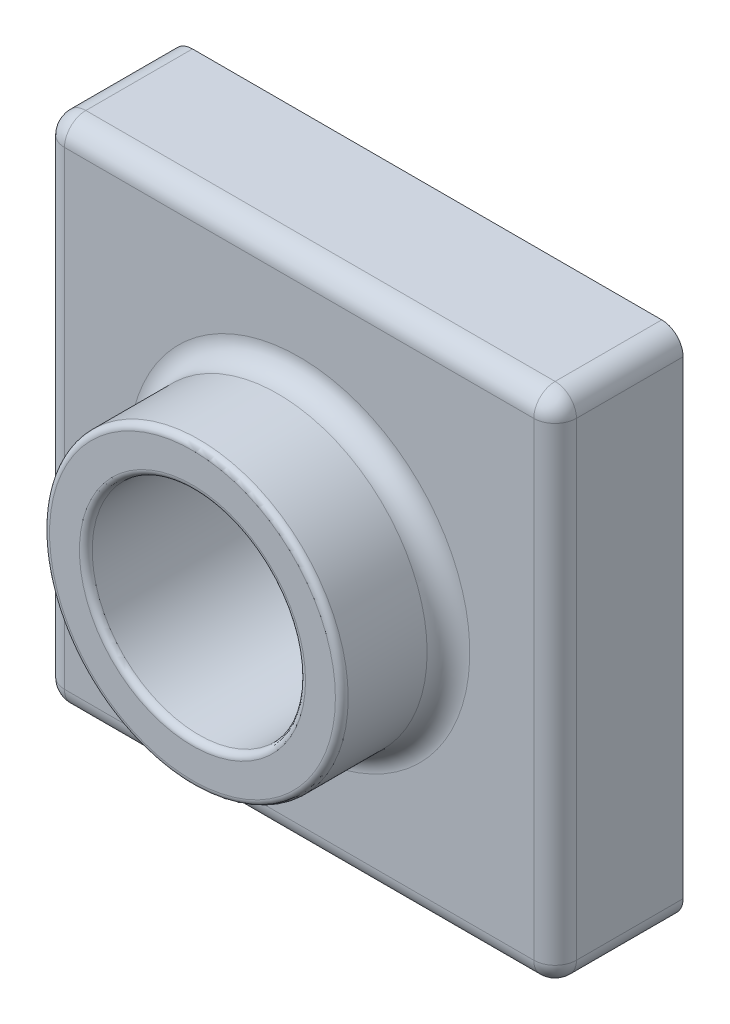
ISO-10303-21;
HEADER;
FILE_DESCRIPTION(('STEP AP214'),'2;1');
FILE_NAME('part.step','',(''),(''),'','','');
FILE_SCHEMA(('AUTOMOTIVE_DESIGN { 1 0 10303 214 1 1 1 1 }'));
ENDSEC;
DATA;
#1=APPLICATION_CONTEXT('core data for automotive mechanical design processes');
#2=APPLICATION_PROTOCOL_DEFINITION('international standard','automotive_design',2000,#1);
#3=PRODUCT_CONTEXT('',#1,'mechanical');
#4=PRODUCT('Part','Part','',(#3));
#5=PRODUCT_RELATED_PRODUCT_CATEGORY('part','',(#4));
#6=PRODUCT_DEFINITION_FORMATION('','',#4);
#7=PRODUCT_DEFINITION_CONTEXT('part definition',#1,'design');
#8=PRODUCT_DEFINITION('design','',#6,#7);
#9=PRODUCT_DEFINITION_SHAPE('','',#8);
#10=(LENGTH_UNIT() NAMED_UNIT(*) SI_UNIT(.MILLI.,.METRE.));
#11=(NAMED_UNIT(*) PLANE_ANGLE_UNIT() SI_UNIT($,.RADIAN.));
#12=(NAMED_UNIT(*) SI_UNIT($,.STERADIAN.) SOLID_ANGLE_UNIT());
#13=UNCERTAINTY_MEASURE_WITH_UNIT(LENGTH_MEASURE(1.E-05),#10,'distance_accuracy_value','');
#14=(GEOMETRIC_REPRESENTATION_CONTEXT(3) GLOBAL_UNCERTAINTY_ASSIGNED_CONTEXT((#13)) GLOBAL_UNIT_ASSIGNED_CONTEXT((#10,
#11,#12)) REPRESENTATION_CONTEXT('',''));
#15=CARTESIAN_POINT('',(0.,0.,0.));
#16=DIRECTION('',(0.,0.,1.));
#17=DIRECTION('',(1.,0.,0.));
#18=AXIS2_PLACEMENT_3D('',#15,#16,#17);
#19=CARTESIAN_POINT('',(0.,0.,0.));
#20=DIRECTION('',(0.,0.,-1.));
#21=DIRECTION('',(-1.,0.,0.));
#22=AXIS2_PLACEMENT_3D('',#19,#20,#21);
#23=PLANE('',#22);
#24=DIRECTION('',(1.,0.,0.));
#25=VECTOR('',#24,1.);
#26=CARTESIAN_POINT('',(0.,0.,0.));
#27=LINE('',#26,#25);
#28=CARTESIAN_POINT('',(5.,0.,0.));
#29=VERTEX_POINT('',#28);
#30=CARTESIAN_POINT('',(115.,0.,0.));
#31=VERTEX_POINT('',#30);
#32=EDGE_CURVE('E281',#29,#31,#27,.T.);
#33=ORIENTED_EDGE('',*,*,#32,.F.);
#34=CARTESIAN_POINT('',(5.,5.,0.));
#35=DIRECTION('',(0.,0.,-1.));
#36=DIRECTION('',(-1.,0.,0.));
#37=AXIS2_PLACEMENT_3D('',#34,#35,#36);
#38=CIRCLE('',#37,5.);
#39=CARTESIAN_POINT('',(0.,5.,0.));
#40=VERTEX_POINT('',#39);
#41=EDGE_CURVE('E325',#29,#40,#38,.T.);
#42=ORIENTED_EDGE('',*,*,#41,.T.);
#43=DIRECTION('',(0.,-1.,0.));
#44=VECTOR('',#43,1.);
#45=CARTESIAN_POINT('',(0.,0.,0.));
#46=LINE('',#45,#44);
#47=CARTESIAN_POINT('',(0.,115.,0.));
#48=VERTEX_POINT('',#47);
#49=EDGE_CURVE('E277',#48,#40,#46,.T.);
#50=ORIENTED_EDGE('',*,*,#49,.F.);
#51=CARTESIAN_POINT('',(5.,115.,0.));
#52=DIRECTION('',(0.,0.,-1.));
#53=DIRECTION('',(-1.,0.,0.));
#54=AXIS2_PLACEMENT_3D('',#51,#52,#53);
#55=CIRCLE('',#54,5.);
#56=CARTESIAN_POINT('',(5.,120.,0.));
#57=VERTEX_POINT('',#56);
#58=EDGE_CURVE('E319',#48,#57,#55,.T.);
#59=ORIENTED_EDGE('',*,*,#58,.T.);
#60=DIRECTION('',(-1.,0.,0.));
#61=VECTOR('',#60,1.);
#62=CARTESIAN_POINT('',(0.,120.,0.));
#63=LINE('',#62,#61);
#64=CARTESIAN_POINT('',(115.,120.,0.));
#65=VERTEX_POINT('',#64);
#66=EDGE_CURVE('E289',#65,#57,#63,.T.);
#67=ORIENTED_EDGE('',*,*,#66,.F.);
#68=CARTESIAN_POINT('',(115.,115.,0.));
#69=DIRECTION('',(0.,0.,-1.));
#70=DIRECTION('',(-1.,0.,0.));
#71=AXIS2_PLACEMENT_3D('',#68,#69,#70);
#72=CIRCLE('',#71,5.);
#73=CARTESIAN_POINT('',(120.,115.,0.));
#74=VERTEX_POINT('',#73);
#75=EDGE_CURVE('E316',#65,#74,#72,.T.);
#76=ORIENTED_EDGE('',*,*,#75,.T.);
#77=DIRECTION('',(0.,1.,0.));
#78=VECTOR('',#77,1.);
#79=CARTESIAN_POINT('',(120.,0.,0.));
#80=LINE('',#79,#78);
#81=CARTESIAN_POINT('',(120.,5.,0.));
#82=VERTEX_POINT('',#81);
#83=EDGE_CURVE('E285',#82,#74,#80,.T.);
#84=ORIENTED_EDGE('',*,*,#83,.F.);
#85=CARTESIAN_POINT('',(115.,5.,0.));
#86=DIRECTION('',(0.,0.,-1.));
#87=DIRECTION('',(-1.,0.,0.));
#88=AXIS2_PLACEMENT_3D('',#85,#86,#87);
#89=CIRCLE('',#88,5.);
#90=EDGE_CURVE('E322',#82,#31,#89,.T.);
#91=ORIENTED_EDGE('',*,*,#90,.T.);
#92=EDGE_LOOP('',(#33,#42,#50,#59,#67,#76,#84,#91));
#93=FACE_BOUND('',#92,.T.);
#94=CARTESIAN_POINT('',(5.,5.,0.));
#95=DIRECTION('',(0.,0.,-1.));
#96=DIRECTION('',(-1.,0.,0.));
#97=AXIS2_PLACEMENT_3D('',#94,#95,#96);
#98=CIRCLE('',#97,3.);
#99=CARTESIAN_POINT('',(5.,2.,0.));
#100=VERTEX_POINT('',#99);
#101=CARTESIAN_POINT('',(2.,5.,0.));
#102=VERTEX_POINT('',#101);
#103=EDGE_CURVE('E209',#100,#102,#98,.T.);
#104=ORIENTED_EDGE('',*,*,#103,.F.);
#105=DIRECTION('',(1.,0.,0.));
#106=VECTOR('',#105,1.);
#107=CARTESIAN_POINT('',(0.,2.,0.));
#108=LINE('',#107,#106);
#109=CARTESIAN_POINT('',(115.,2.,0.));
#110=VERTEX_POINT('',#109);
#111=EDGE_CURVE('E247',#100,#110,#108,.T.);
#112=ORIENTED_EDGE('',*,*,#111,.T.);
#113=CARTESIAN_POINT('',(115.,5.,0.));
#114=DIRECTION('',(0.,0.,-1.));
#115=DIRECTION('',(-1.,0.,0.));
#116=AXIS2_PLACEMENT_3D('',#113,#114,#115);
#117=CIRCLE('',#116,3.);
#118=CARTESIAN_POINT('',(118.,5.,0.));
#119=VERTEX_POINT('',#118);
#120=EDGE_CURVE('E252',#119,#110,#117,.T.);
#121=ORIENTED_EDGE('',*,*,#120,.F.);
#122=DIRECTION('',(0.,1.,0.));
#123=VECTOR('',#122,1.);
#124=CARTESIAN_POINT('',(118.,0.,0.));
#125=LINE('',#124,#123);
#126=CARTESIAN_POINT('',(118.,115.,0.));
#127=VERTEX_POINT('',#126);
#128=EDGE_CURVE('E59',#119,#127,#125,.T.);
#129=ORIENTED_EDGE('',*,*,#128,.T.);
#130=CARTESIAN_POINT('',(115.,115.,0.));
#131=DIRECTION('',(0.,0.,-1.));
#132=DIRECTION('',(-1.,0.,0.));
#133=AXIS2_PLACEMENT_3D('',#130,#131,#132);
#134=CIRCLE('',#133,3.);
#135=CARTESIAN_POINT('',(115.,118.,0.));
#136=VERTEX_POINT('',#135);
#137=EDGE_CURVE('E253',#136,#127,#134,.T.);
#138=ORIENTED_EDGE('',*,*,#137,.F.);
#139=DIRECTION('',(-1.,0.,0.));
#140=VECTOR('',#139,1.);
#141=CARTESIAN_POINT('',(0.,118.,0.));
#142=LINE('',#141,#140);
#143=CARTESIAN_POINT('',(5.,118.,0.));
#144=VERTEX_POINT('',#143);
#145=EDGE_CURVE('E240',#136,#144,#142,.T.);
#146=ORIENTED_EDGE('',*,*,#145,.T.);
#147=CARTESIAN_POINT('',(5.,115.,0.));
#148=DIRECTION('',(0.,0.,-1.));
#149=DIRECTION('',(-1.,0.,0.));
#150=AXIS2_PLACEMENT_3D('',#147,#148,#149);
#151=CIRCLE('',#150,3.);
#152=CARTESIAN_POINT('',(2.,115.,0.));
#153=VERTEX_POINT('',#152);
#154=EDGE_CURVE('E249',#153,#144,#151,.T.);
#155=ORIENTED_EDGE('',*,*,#154,.F.);
#156=DIRECTION('',(0.,-1.,0.));
#157=VECTOR('',#156,1.);
#158=CARTESIAN_POINT('',(2.,0.,0.));
#159=LINE('',#158,#157);
#160=EDGE_CURVE('E204',#153,#102,#159,.T.);
#161=ORIENTED_EDGE('',*,*,#160,.T.);
#162=EDGE_LOOP('',(#104,#112,#121,#129,#138,#146,#155,#161));
#163=FACE_BOUND('',#162,.T.);
#164=ADVANCED_FACE('F41',(#93,#163),#23,.T.);
#165=CARTESIAN_POINT('',(0.,0.,30.));
#166=DIRECTION('',(1.,0.,0.));
#167=DIRECTION('',(0.,0.,-1.));
#168=AXIS2_PLACEMENT_3D('',#165,#166,#167);
#169=PLANE('',#168);
#170=DIRECTION('',(0.,0.,-1.));
#171=VECTOR('',#170,1.);
#172=CARTESIAN_POINT('',(0.,5.,30.));
#173=LINE('',#172,#171);
#174=CARTESIAN_POINT('',(0.,5.,25.));
#175=VERTEX_POINT('',#174);
#176=EDGE_CURVE('E331',#40,#175,#173,.F.);
#177=ORIENTED_EDGE('',*,*,#176,.T.);
#178=DIRECTION('',(0.,-1.,0.));
#179=VECTOR('',#178,1.);
#180=CARTESIAN_POINT('',(0.,0.,25.));
#181=LINE('',#180,#179);
#182=CARTESIAN_POINT('',(0.,115.,25.));
#183=VERTEX_POINT('',#182);
#184=EDGE_CURVE('E51',#175,#183,#181,.F.);
#185=ORIENTED_EDGE('',*,*,#184,.T.);
#186=DIRECTION('',(0.,0.,-1.));
#187=VECTOR('',#186,1.);
#188=CARTESIAN_POINT('',(0.,115.,30.));
#189=LINE('',#188,#187);
#190=EDGE_CURVE('E328',#183,#48,#189,.T.);
#191=ORIENTED_EDGE('',*,*,#190,.T.);
#192=ORIENTED_EDGE('',*,*,#49,.T.);
#193=EDGE_LOOP('',(#177,#185,#191,#192));
#194=FACE_BOUND('',#193,.T.);
#195=ADVANCED_FACE('F471',(#194),#169,.F.);
#196=CARTESIAN_POINT('',(0.,0.,30.));
#197=DIRECTION('',(0.,1.,0.));
#198=DIRECTION('',(0.,0.,1.));
#199=AXIS2_PLACEMENT_3D('',#196,#197,#198);
#200=PLANE('',#199);
#201=DIRECTION('',(0.,0.,-1.));
#202=VECTOR('',#201,1.);
#203=CARTESIAN_POINT('',(115.,0.,30.));
#204=LINE('',#203,#202);
#205=CARTESIAN_POINT('',(115.,0.,25.));
#206=VERTEX_POINT('',#205);
#207=EDGE_CURVE('E309',#31,#206,#204,.F.);
#208=ORIENTED_EDGE('',*,*,#207,.T.);
#209=DIRECTION('',(1.,0.,0.));
#210=VECTOR('',#209,1.);
#211=CARTESIAN_POINT('',(0.,0.,25.));
#212=LINE('',#211,#210);
#213=CARTESIAN_POINT('',(5.,0.,25.));
#214=VERTEX_POINT('',#213);
#215=EDGE_CURVE('E381',#206,#214,#212,.F.);
#216=ORIENTED_EDGE('',*,*,#215,.T.);
#217=DIRECTION('',(0.,0.,-1.));
#218=VECTOR('',#217,1.);
#219=CARTESIAN_POINT('',(5.,0.,30.));
#220=LINE('',#219,#218);
#221=EDGE_CURVE('E313',#214,#29,#220,.T.);
#222=ORIENTED_EDGE('',*,*,#221,.T.);
#223=ORIENTED_EDGE('',*,*,#32,.T.);
#224=EDGE_LOOP('',(#208,#216,#222,#223));
#225=FACE_BOUND('',#224,.T.);
#226=ADVANCED_FACE('F432',(#225),#200,.F.);
#227=CARTESIAN_POINT('',(120.,0.,30.));
#228=DIRECTION('',(-1.,0.,0.));
#229=DIRECTION('',(0.,0.,1.));
#230=AXIS2_PLACEMENT_3D('',#227,#228,#229);
#231=PLANE('',#230);
#232=DIRECTION('',(0.,0.,-1.));
#233=VECTOR('',#232,1.);
#234=CARTESIAN_POINT('',(120.,115.,30.));
#235=LINE('',#234,#233);
#236=CARTESIAN_POINT('',(120.,115.,25.));
#237=VERTEX_POINT('',#236);
#238=EDGE_CURVE('E334',#74,#237,#235,.F.);
#239=ORIENTED_EDGE('',*,*,#238,.T.);
#240=DIRECTION('',(0.,1.,0.));
#241=VECTOR('',#240,1.);
#242=CARTESIAN_POINT('',(120.,0.,25.));
#243=LINE('',#242,#241);
#244=CARTESIAN_POINT('',(120.,5.,25.));
#245=VERTEX_POINT('',#244);
#246=EDGE_CURVE('E375',#237,#245,#243,.F.);
#247=ORIENTED_EDGE('',*,*,#246,.T.);
#248=DIRECTION('',(0.,0.,-1.));
#249=VECTOR('',#248,1.);
#250=CARTESIAN_POINT('',(120.,5.,30.));
#251=LINE('',#250,#249);
#252=EDGE_CURVE('E338',#245,#82,#251,.T.);
#253=ORIENTED_EDGE('',*,*,#252,.T.);
#254=ORIENTED_EDGE('',*,*,#83,.T.);
#255=EDGE_LOOP('',(#239,#247,#253,#254));
#256=FACE_BOUND('',#255,.T.);
#257=ADVANCED_FACE('F443',(#256),#231,.F.);
#258=CARTESIAN_POINT('',(0.,120.,30.));
#259=DIRECTION('',(0.,-1.,0.));
#260=DIRECTION('',(0.,0.,-1.));
#261=AXIS2_PLACEMENT_3D('',#258,#259,#260);
#262=PLANE('',#261);
#263=DIRECTION('',(0.,0.,-1.));
#264=VECTOR('',#263,1.);
#265=CARTESIAN_POINT('',(5.,120.,30.));
#266=LINE('',#265,#264);
#267=CARTESIAN_POINT('',(5.,120.,25.));
#268=VERTEX_POINT('',#267);
#269=EDGE_CURVE('E344',#57,#268,#266,.F.);
#270=ORIENTED_EDGE('',*,*,#269,.T.);
#271=DIRECTION('',(-1.,0.,0.));
#272=VECTOR('',#271,1.);
#273=CARTESIAN_POINT('',(0.,120.,25.));
#274=LINE('',#273,#272);
#275=CARTESIAN_POINT('',(115.,120.,25.));
#276=VERTEX_POINT('',#275);
#277=EDGE_CURVE('E369',#268,#276,#274,.F.);
#278=ORIENTED_EDGE('',*,*,#277,.T.);
#279=DIRECTION('',(0.,0.,-1.));
#280=VECTOR('',#279,1.);
#281=CARTESIAN_POINT('',(115.,120.,30.));
#282=LINE('',#281,#280);
#283=EDGE_CURVE('E341',#276,#65,#282,.T.);
#284=ORIENTED_EDGE('',*,*,#283,.T.);
#285=ORIENTED_EDGE('',*,*,#66,.T.);
#286=EDGE_LOOP('',(#270,#278,#284,#285));
#287=FACE_BOUND('',#286,.T.);
#288=ADVANCED_FACE('F507',(#287),#262,.F.);
#289=CARTESIAN_POINT('',(0.,0.,30.));
#290=DIRECTION('',(0.,0.,-1.));
#291=DIRECTION('',(-1.,0.,0.));
#292=AXIS2_PLACEMENT_3D('',#289,#290,#291);
#293=PLANE('',#292);
#294=DIRECTION('',(0.,1.,0.));
#295=VECTOR('',#294,1.);
#296=CARTESIAN_POINT('',(115.,0.,30.));
#297=LINE('',#296,#295);
#298=CARTESIAN_POINT('',(115.,5.,30.));
#299=VERTEX_POINT('',#298);
#300=CARTESIAN_POINT('',(115.,115.,30.));
#301=VERTEX_POINT('',#300);
#302=EDGE_CURVE('E362',#299,#301,#297,.T.);
#303=ORIENTED_EDGE('',*,*,#302,.T.);
#304=DIRECTION('',(-1.,0.,0.));
#305=VECTOR('',#304,1.);
#306=CARTESIAN_POINT('',(0.,115.,30.));
#307=LINE('',#306,#305);
#308=CARTESIAN_POINT('',(5.,115.,30.));
#309=VERTEX_POINT('',#308);
#310=EDGE_CURVE('E365',#301,#309,#307,.T.);
#311=ORIENTED_EDGE('',*,*,#310,.T.);
#312=DIRECTION('',(0.,-1.,0.));
#313=VECTOR('',#312,1.);
#314=CARTESIAN_POINT('',(5.,0.,30.));
#315=LINE('',#314,#313);
#316=CARTESIAN_POINT('',(5.,5.,30.));
#317=VERTEX_POINT('',#316);
#318=EDGE_CURVE('E356',#309,#317,#315,.T.);
#319=ORIENTED_EDGE('',*,*,#318,.T.);
#320=DIRECTION('',(1.,0.,0.));
#321=VECTOR('',#320,1.);
#322=CARTESIAN_POINT('',(0.,5.,30.));
#323=LINE('',#322,#321);
#324=EDGE_CURVE('E359',#317,#299,#323,.T.);
#325=ORIENTED_EDGE('',*,*,#324,.T.);
#326=EDGE_LOOP('',(#303,#311,#319,#325));
#327=FACE_BOUND('',#326,.T.);
#328=CARTESIAN_POINT('',(60.,60.,30.));
#329=DIRECTION('',(0.,0.,-1.));
#330=DIRECTION('',(-1.,0.,0.));
#331=AXIS2_PLACEMENT_3D('',#328,#329,#330);
#332=CIRCLE('',#331,40.);
#333=CARTESIAN_POINT('',(20.,60.,30.));
#334=VERTEX_POINT('',#333);
#335=EDGE_CURVE('E352',#334,#334,#332,.T.);
#336=ORIENTED_EDGE('',*,*,#335,.T.);
#337=EDGE_LOOP('',(#336));
#338=FACE_BOUND('',#337,.T.);
#339=ADVANCED_FACE('F458',(#327,#338),#293,.F.);
#340=CARTESIAN_POINT('',(60.,60.,0.));
#341=DIRECTION('',(0.,0.,-1.));
#342=DIRECTION('',(-1.,0.,0.));
#343=AXIS2_PLACEMENT_3D('',#340,#341,#342);
#344=CIRCLE('',#343,27.);
#345=CARTESIAN_POINT('',(33.,60.,0.));
#346=VERTEX_POINT('',#345);
#347=EDGE_CURVE('E248',#346,#346,#344,.F.);
#348=ORIENTED_EDGE('',*,*,#347,.F.);
#349=EDGE_LOOP('',(#348));
#350=FACE_BOUND('',#349,.T.);
#351=CARTESIAN_POINT('',(60.,60.,0.));
#352=DIRECTION('',(0.,0.,1.));
#353=DIRECTION('',(1.,0.,0.));
#354=AXIS2_PLACEMENT_3D('',#351,#352,#353);
#355=CIRCLE('',#354,25.);
#356=CARTESIAN_POINT('',(85.,60.,0.));
#357=VERTEX_POINT('',#356);
#358=EDGE_CURVE('E273',#357,#357,#355,.T.);
#359=ORIENTED_EDGE('',*,*,#358,.T.);
#360=EDGE_LOOP('',(#359));
#361=FACE_BOUND('',#360,.T.);
#362=ADVANCED_FACE('F490',(#350,#361),#23,.T.);
#363=CARTESIAN_POINT('',(60.,60.,55.));
#364=DIRECTION('',(0.,0.,-1.));
#365=DIRECTION('',(-1.,0.,0.));
#366=AXIS2_PLACEMENT_3D('',#363,#364,#365);
#367=CYLINDRICAL_SURFACE('',#366,35.);
#368=CARTESIAN_POINT('',(60.,60.,35.));
#369=DIRECTION('',(0.,0.,-1.));
#370=DIRECTION('',(-1.,0.,0.));
#371=AXIS2_PLACEMENT_3D('',#368,#369,#370);
#372=CIRCLE('',#371,35.);
#373=CARTESIAN_POINT('',(25.,60.,35.));
#374=VERTEX_POINT('',#373);
#375=EDGE_CURVE('E11',#374,#374,#372,.F.);
#376=ORIENTED_EDGE('',*,*,#375,.T.);
#377=EDGE_LOOP('',(#376));
#378=FACE_BOUND('',#377,.T.);
#379=CARTESIAN_POINT('',(60.,60.,53.5));
#380=DIRECTION('',(0.,0.,1.));
#381=DIRECTION('',(1.,0.,0.));
#382=AXIS2_PLACEMENT_3D('',#379,#380,#381);
#383=CIRCLE('',#382,35.);
#384=CARTESIAN_POINT('',(95.,60.,53.5));
#385=VERTEX_POINT('',#384);
#386=EDGE_CURVE('E301',#385,#385,#383,.F.);
#387=ORIENTED_EDGE('',*,*,#386,.T.);
#388=EDGE_LOOP('',(#387));
#389=FACE_BOUND('',#388,.T.);
#390=ADVANCED_FACE('F498',(#378,#389),#367,.T.);
#391=CARTESIAN_POINT('',(60.,60.,55.));
#392=DIRECTION('',(0.,0.,1.));
#393=DIRECTION('',(1.,0.,0.));
#394=AXIS2_PLACEMENT_3D('',#391,#392,#393);
#395=PLANE('',#394);
#396=CARTESIAN_POINT('',(60.,60.,55.));
#397=DIRECTION('',(0.,0.,1.));
#398=DIRECTION('',(1.,0.,0.));
#399=AXIS2_PLACEMENT_3D('',#396,#397,#398);
#400=CIRCLE('',#399,33.5);
#401=CARTESIAN_POINT('',(93.5,60.,55.));
#402=VERTEX_POINT('',#401);
#403=EDGE_CURVE('E297',#402,#402,#400,.T.);
#404=ORIENTED_EDGE('',*,*,#403,.T.);
#405=EDGE_LOOP('',(#404));
#406=FACE_BOUND('',#405,.T.);
#407=CARTESIAN_POINT('',(60.,60.,55.));
#408=DIRECTION('',(0.,0.,1.));
#409=DIRECTION('',(1.,0.,0.));
#410=AXIS2_PLACEMENT_3D('',#407,#408,#409);
#411=CIRCLE('',#410,26.5);
#412=CARTESIAN_POINT('',(86.5,60.,55.));
#413=VERTEX_POINT('',#412);
#414=EDGE_CURVE('E293',#413,#413,#411,.F.);
#415=ORIENTED_EDGE('',*,*,#414,.T.);
#416=EDGE_LOOP('',(#415));
#417=FACE_BOUND('',#416,.T.);
#418=ADVANCED_FACE('F504',(#406,#417),#395,.T.);
#419=CARTESIAN_POINT('',(60.,60.,0.));
#420=DIRECTION('',(0.,0.,1.));
#421=DIRECTION('',(1.,0.,0.));
#422=AXIS2_PLACEMENT_3D('',#419,#420,#421);
#423=CYLINDRICAL_SURFACE('',#422,25.);
#424=CARTESIAN_POINT('',(60.,60.,53.5));
#425=DIRECTION('',(0.,0.,1.));
#426=DIRECTION('',(1.,0.,0.));
#427=AXIS2_PLACEMENT_3D('',#424,#425,#426);
#428=CIRCLE('',#427,25.);
#429=CARTESIAN_POINT('',(85.,60.,53.5));
#430=VERTEX_POINT('',#429);
#431=EDGE_CURVE('E305',#430,#430,#428,.T.);
#432=ORIENTED_EDGE('',*,*,#431,.T.);
#433=EDGE_LOOP('',(#432));
#434=FACE_BOUND('',#433,.T.);
#435=ORIENTED_EDGE('',*,*,#358,.F.);
#436=EDGE_LOOP('',(#435));
#437=FACE_BOUND('',#436,.T.);
#438=ADVANCED_FACE('F512',(#434,#437),#423,.F.);
#439=CARTESIAN_POINT('',(60.,60.,53.5));
#440=DIRECTION('',(0.,0.,1.));
#441=DIRECTION('',(1.,0.,0.));
#442=AXIS2_PLACEMENT_3D('',#439,#440,#441);
#443=TOROIDAL_SURFACE('',#442,33.5,1.5);
#444=ORIENTED_EDGE('',*,*,#386,.F.);
#445=EDGE_LOOP('',(#444));
#446=FACE_BOUND('',#445,.T.);
#447=ORIENTED_EDGE('',*,*,#403,.F.);
#448=EDGE_LOOP('',(#447));
#449=FACE_BOUND('',#448,.T.);
#450=ADVANCED_FACE('F514',(#446,#449),#443,.T.);
#451=CARTESIAN_POINT('',(60.,60.,53.5));
#452=DIRECTION('',(0.,0.,1.));
#453=DIRECTION('',(1.,0.,0.));
#454=AXIS2_PLACEMENT_3D('',#451,#452,#453);
#455=TOROIDAL_SURFACE('',#454,26.5,1.5);
#456=ORIENTED_EDGE('',*,*,#414,.F.);
#457=EDGE_LOOP('',(#456));
#458=FACE_BOUND('',#457,.T.);
#459=ORIENTED_EDGE('',*,*,#431,.F.);
#460=EDGE_LOOP('',(#459));
#461=FACE_BOUND('',#460,.T.);
#462=ADVANCED_FACE('F521',(#458,#461),#455,.T.);
#463=CARTESIAN_POINT('',(5.,5.,30.));
#464=DIRECTION('',(0.,0.,-1.));
#465=DIRECTION('',(-1.,0.,0.));
#466=AXIS2_PLACEMENT_3D('',#463,#464,#465);
#467=CYLINDRICAL_SURFACE('',#466,5.);
#468=ORIENTED_EDGE('',*,*,#221,.F.);
#469=CARTESIAN_POINT('',(5.,5.,25.));
#470=DIRECTION('',(0.,0.,-1.));
#471=DIRECTION('',(-1.,0.,0.));
#472=AXIS2_PLACEMENT_3D('',#469,#470,#471);
#473=CIRCLE('',#472,5.);
#474=EDGE_CURVE('E67',#214,#175,#473,.T.);
#475=ORIENTED_EDGE('',*,*,#474,.T.);
#476=ORIENTED_EDGE('',*,*,#176,.F.);
#477=ORIENTED_EDGE('',*,*,#41,.F.);
#478=EDGE_LOOP('',(#468,#475,#476,#477));
#479=FACE_BOUND('',#478,.T.);
#480=ADVANCED_FACE('F822',(#479),#467,.T.);
#481=CARTESIAN_POINT('',(115.,5.,30.));
#482=DIRECTION('',(0.,0.,-1.));
#483=DIRECTION('',(-1.,0.,0.));
#484=AXIS2_PLACEMENT_3D('',#481,#482,#483);
#485=CYLINDRICAL_SURFACE('',#484,5.);
#486=ORIENTED_EDGE('',*,*,#252,.F.);
#487=CARTESIAN_POINT('',(115.,5.,25.));
#488=DIRECTION('',(0.,0.,-1.));
#489=DIRECTION('',(-1.,0.,0.));
#490=AXIS2_PLACEMENT_3D('',#487,#488,#489);
#491=CIRCLE('',#490,5.);
#492=EDGE_CURVE('E378',#245,#206,#491,.T.);
#493=ORIENTED_EDGE('',*,*,#492,.T.);
#494=ORIENTED_EDGE('',*,*,#207,.F.);
#495=ORIENTED_EDGE('',*,*,#90,.F.);
#496=EDGE_LOOP('',(#486,#493,#494,#495));
#497=FACE_BOUND('',#496,.T.);
#498=ADVANCED_FACE('F429',(#497),#485,.T.);
#499=CARTESIAN_POINT('',(5.,115.,30.));
#500=DIRECTION('',(0.,0.,-1.));
#501=DIRECTION('',(-1.,0.,0.));
#502=AXIS2_PLACEMENT_3D('',#499,#500,#501);
#503=CYLINDRICAL_SURFACE('',#502,5.);
#504=ORIENTED_EDGE('',*,*,#190,.F.);
#505=CARTESIAN_POINT('',(5.,115.,25.));
#506=DIRECTION('',(0.,0.,-1.));
#507=DIRECTION('',(-1.,0.,0.));
#508=AXIS2_PLACEMENT_3D('',#505,#506,#507);
#509=CIRCLE('',#508,5.);
#510=EDGE_CURVE('E348',#183,#268,#509,.T.);
#511=ORIENTED_EDGE('',*,*,#510,.T.);
#512=ORIENTED_EDGE('',*,*,#269,.F.);
#513=ORIENTED_EDGE('',*,*,#58,.F.);
#514=EDGE_LOOP('',(#504,#511,#512,#513));
#515=FACE_BOUND('',#514,.T.);
#516=ADVANCED_FACE('F475',(#515),#503,.T.);
#517=CARTESIAN_POINT('',(115.,115.,30.));
#518=DIRECTION('',(0.,0.,-1.));
#519=DIRECTION('',(-1.,0.,0.));
#520=AXIS2_PLACEMENT_3D('',#517,#518,#519);
#521=CYLINDRICAL_SURFACE('',#520,5.);
#522=ORIENTED_EDGE('',*,*,#283,.F.);
#523=CARTESIAN_POINT('',(115.,115.,25.));
#524=DIRECTION('',(0.,0.,-1.));
#525=DIRECTION('',(-1.,0.,0.));
#526=AXIS2_PLACEMENT_3D('',#523,#524,#525);
#527=CIRCLE('',#526,5.);
#528=EDGE_CURVE('E372',#276,#237,#527,.T.);
#529=ORIENTED_EDGE('',*,*,#528,.T.);
#530=ORIENTED_EDGE('',*,*,#238,.F.);
#531=ORIENTED_EDGE('',*,*,#75,.F.);
#532=EDGE_LOOP('',(#522,#529,#530,#531));
#533=FACE_BOUND('',#532,.T.);
#534=ADVANCED_FACE('F446',(#533),#521,.T.);
#535=CARTESIAN_POINT('',(115.,5.,25.));
#536=DIRECTION('',(0.,0.,-1.));
#537=DIRECTION('',(-1.,0.,0.));
#538=AXIS2_PLACEMENT_3D('',#535,#536,#537);
#539=SPHERICAL_SURFACE('',#538,5.);
#540=CARTESIAN_POINT('',(115.,5.,25.));
#541=DIRECTION('',(-1.,0.,0.));
#542=DIRECTION('',(0.,0.,1.));
#543=AXIS2_PLACEMENT_3D('',#540,#541,#542);
#544=CIRCLE('',#543,5.);
#545=EDGE_CURVE('E408',#206,#299,#544,.T.);
#546=ORIENTED_EDGE('',*,*,#545,.F.);
#547=ORIENTED_EDGE('',*,*,#492,.F.);
#548=CARTESIAN_POINT('',(115.,5.,25.));
#549=DIRECTION('',(0.,1.,0.));
#550=DIRECTION('',(0.,0.,1.));
#551=AXIS2_PLACEMENT_3D('',#548,#549,#550);
#552=CIRCLE('',#551,5.);
#553=EDGE_CURVE('E45',#299,#245,#552,.T.);
#554=ORIENTED_EDGE('',*,*,#553,.F.);
#555=EDGE_LOOP('',(#546,#547,#554));
#556=FACE_BOUND('',#555,.T.);
#557=ADVANCED_FACE('F425',(#556),#539,.T.);
#558=CARTESIAN_POINT('',(115.,0.,25.));
#559=DIRECTION('',(0.,1.,0.));
#560=DIRECTION('',(0.,0.,1.));
#561=AXIS2_PLACEMENT_3D('',#558,#559,#560);
#562=CYLINDRICAL_SURFACE('',#561,5.);
#563=ORIENTED_EDGE('',*,*,#553,.T.);
#564=ORIENTED_EDGE('',*,*,#246,.F.);
#565=CARTESIAN_POINT('',(115.,115.,25.));
#566=DIRECTION('',(0.,1.,0.));
#567=DIRECTION('',(0.,0.,1.));
#568=AXIS2_PLACEMENT_3D('',#565,#566,#567);
#569=CIRCLE('',#568,5.);
#570=EDGE_CURVE('E405',#301,#237,#569,.T.);
#571=ORIENTED_EDGE('',*,*,#570,.F.);
#572=ORIENTED_EDGE('',*,*,#302,.F.);
#573=EDGE_LOOP('',(#563,#564,#571,#572));
#574=FACE_BOUND('',#573,.T.);
#575=ADVANCED_FACE('F421',(#574),#562,.T.);
#576=CARTESIAN_POINT('',(0.,5.,25.));
#577=DIRECTION('',(1.,0.,0.));
#578=DIRECTION('',(0.,0.,-1.));
#579=AXIS2_PLACEMENT_3D('',#576,#577,#578);
#580=CYLINDRICAL_SURFACE('',#579,5.);
#581=ORIENTED_EDGE('',*,*,#545,.T.);
#582=ORIENTED_EDGE('',*,*,#324,.F.);
#583=CARTESIAN_POINT('',(5.,5.,25.));
#584=DIRECTION('',(-1.,0.,0.));
#585=DIRECTION('',(0.,0.,1.));
#586=AXIS2_PLACEMENT_3D('',#583,#584,#585);
#587=CIRCLE('',#586,5.);
#588=EDGE_CURVE('E401',#214,#317,#587,.T.);
#589=ORIENTED_EDGE('',*,*,#588,.F.);
#590=ORIENTED_EDGE('',*,*,#215,.F.);
#591=EDGE_LOOP('',(#581,#582,#589,#590));
#592=FACE_BOUND('',#591,.T.);
#593=ADVANCED_FACE('F461',(#592),#580,.T.);
#594=CARTESIAN_POINT('',(115.,115.,25.));
#595=DIRECTION('',(0.,0.,-1.));
#596=DIRECTION('',(-1.,0.,0.));
#597=AXIS2_PLACEMENT_3D('',#594,#595,#596);
#598=SPHERICAL_SURFACE('',#597,5.);
#599=ORIENTED_EDGE('',*,*,#570,.T.);
#600=ORIENTED_EDGE('',*,*,#528,.F.);
#601=CARTESIAN_POINT('',(115.,115.,25.));
#602=DIRECTION('',(-1.,0.,0.));
#603=DIRECTION('',(0.,0.,1.));
#604=AXIS2_PLACEMENT_3D('',#601,#602,#603);
#605=CIRCLE('',#604,5.);
#606=EDGE_CURVE('E397',#301,#276,#605,.T.);
#607=ORIENTED_EDGE('',*,*,#606,.F.);
#608=EDGE_LOOP('',(#599,#600,#607));
#609=FACE_BOUND('',#608,.T.);
#610=ADVANCED_FACE('F450',(#609),#598,.T.);
#611=CARTESIAN_POINT('',(5.,5.,25.));
#612=DIRECTION('',(0.,0.,-1.));
#613=DIRECTION('',(-1.,0.,0.));
#614=AXIS2_PLACEMENT_3D('',#611,#612,#613);
#615=SPHERICAL_SURFACE('',#614,5.);
#616=ORIENTED_EDGE('',*,*,#474,.F.);
#617=ORIENTED_EDGE('',*,*,#588,.T.);
#618=CARTESIAN_POINT('',(5.,5.,25.));
#619=DIRECTION('',(0.,1.,0.));
#620=DIRECTION('',(0.,0.,1.));
#621=AXIS2_PLACEMENT_3D('',#618,#619,#620);
#622=CIRCLE('',#621,5.);
#623=EDGE_CURVE('E393',#175,#317,#622,.T.);
#624=ORIENTED_EDGE('',*,*,#623,.F.);
#625=EDGE_LOOP('',(#616,#617,#624));
#626=FACE_BOUND('',#625,.T.);
#627=ADVANCED_FACE('F464',(#626),#615,.T.);
#628=CARTESIAN_POINT('',(0.,115.,25.));
#629=DIRECTION('',(-1.,0.,0.));
#630=DIRECTION('',(0.,0.,1.));
#631=AXIS2_PLACEMENT_3D('',#628,#629,#630);
#632=CYLINDRICAL_SURFACE('',#631,5.);
#633=ORIENTED_EDGE('',*,*,#606,.T.);
#634=ORIENTED_EDGE('',*,*,#277,.F.);
#635=CARTESIAN_POINT('',(5.,115.,25.));
#636=DIRECTION('',(-1.,0.,0.));
#637=DIRECTION('',(0.,0.,1.));
#638=AXIS2_PLACEMENT_3D('',#635,#636,#637);
#639=CIRCLE('',#638,5.);
#640=EDGE_CURVE('E390',#309,#268,#639,.T.);
#641=ORIENTED_EDGE('',*,*,#640,.F.);
#642=ORIENTED_EDGE('',*,*,#310,.F.);
#643=EDGE_LOOP('',(#633,#634,#641,#642));
#644=FACE_BOUND('',#643,.T.);
#645=ADVANCED_FACE('F454',(#644),#632,.T.);
#646=CARTESIAN_POINT('',(5.,0.,25.));
#647=DIRECTION('',(0.,-1.,0.));
#648=DIRECTION('',(0.,0.,-1.));
#649=AXIS2_PLACEMENT_3D('',#646,#647,#648);
#650=CYLINDRICAL_SURFACE('',#649,5.);
#651=ORIENTED_EDGE('',*,*,#623,.T.);
#652=ORIENTED_EDGE('',*,*,#318,.F.);
#653=CARTESIAN_POINT('',(5.,115.,25.));
#654=DIRECTION('',(0.,1.,0.));
#655=DIRECTION('',(0.,0.,1.));
#656=AXIS2_PLACEMENT_3D('',#653,#654,#655);
#657=CIRCLE('',#656,5.);
#658=EDGE_CURVE('E234',#183,#309,#657,.T.);
#659=ORIENTED_EDGE('',*,*,#658,.F.);
#660=ORIENTED_EDGE('',*,*,#184,.F.);
#661=EDGE_LOOP('',(#651,#652,#659,#660));
#662=FACE_BOUND('',#661,.T.);
#663=ADVANCED_FACE('F467',(#662),#650,.T.);
#664=CARTESIAN_POINT('',(5.,115.,25.));
#665=DIRECTION('',(0.,0.,-1.));
#666=DIRECTION('',(-1.,0.,0.));
#667=AXIS2_PLACEMENT_3D('',#664,#665,#666);
#668=SPHERICAL_SURFACE('',#667,5.);
#669=ORIENTED_EDGE('',*,*,#640,.T.);
#670=ORIENTED_EDGE('',*,*,#510,.F.);
#671=ORIENTED_EDGE('',*,*,#658,.T.);
#672=EDGE_LOOP('',(#669,#670,#671));
#673=FACE_BOUND('',#672,.T.);
#674=ADVANCED_FACE('F478',(#673),#668,.T.);
#675=CARTESIAN_POINT('',(60.,60.,35.));
#676=DIRECTION('',(0.,0.,-1.));
#677=DIRECTION('',(-1.,0.,0.));
#678=AXIS2_PLACEMENT_3D('',#675,#676,#677);
#679=TOROIDAL_SURFACE('',#678,40.,5.);
#680=ORIENTED_EDGE('',*,*,#335,.F.);
#681=EDGE_LOOP('',(#680));
#682=FACE_BOUND('',#681,.T.);
#683=ORIENTED_EDGE('',*,*,#375,.F.);
#684=EDGE_LOOP('',(#683));
#685=FACE_BOUND('',#684,.T.);
#686=ADVANCED_FACE('F43',(#682,#685),#679,.F.);
#687=CARTESIAN_POINT('',(2.,0.,30.));
#688=DIRECTION('',(1.,0.,0.));
#689=DIRECTION('',(0.,0.,-1.));
#690=AXIS2_PLACEMENT_3D('',#687,#688,#689);
#691=PLANE('',#690);
#692=DIRECTION('',(0.,0.,-1.));
#693=VECTOR('',#692,1.);
#694=CARTESIAN_POINT('',(2.,5.,30.));
#695=LINE('',#694,#693);
#696=CARTESIAN_POINT('',(2.,5.,25.));
#697=VERTEX_POINT('',#696);
#698=EDGE_CURVE('E208',#102,#697,#695,.F.);
#699=ORIENTED_EDGE('',*,*,#698,.F.);
#700=ORIENTED_EDGE('',*,*,#160,.F.);
#701=DIRECTION('',(0.,0.,-1.));
#702=VECTOR('',#701,1.);
#703=CARTESIAN_POINT('',(2.,115.,30.));
#704=LINE('',#703,#702);
#705=CARTESIAN_POINT('',(2.,115.,25.));
#706=VERTEX_POINT('',#705);
#707=EDGE_CURVE('E200',#706,#153,#704,.T.);
#708=ORIENTED_EDGE('',*,*,#707,.F.);
#709=DIRECTION('',(0.,1.,0.));
#710=VECTOR('',#709,1.);
#711=CARTESIAN_POINT('',(2.,0.,25.));
#712=LINE('',#711,#710);
#713=EDGE_CURVE('E185',#697,#706,#712,.T.);
#714=ORIENTED_EDGE('',*,*,#713,.F.);
#715=EDGE_LOOP('',(#699,#700,#708,#714));
#716=FACE_BOUND('',#715,.T.);
#717=ADVANCED_FACE('F202',(#716),#691,.T.);
#718=CARTESIAN_POINT('',(0.,2.,30.));
#719=DIRECTION('',(0.,1.,0.));
#720=DIRECTION('',(0.,0.,1.));
#721=AXIS2_PLACEMENT_3D('',#718,#719,#720);
#722=PLANE('',#721);
#723=DIRECTION('',(0.,0.,1.));
#724=VECTOR('',#723,1.);
#725=CARTESIAN_POINT('',(115.,2.,30.));
#726=LINE('',#725,#724);
#727=CARTESIAN_POINT('',(115.,2.,25.));
#728=VERTEX_POINT('',#727);
#729=EDGE_CURVE('E244',#110,#728,#726,.T.);
#730=ORIENTED_EDGE('',*,*,#729,.F.);
#731=ORIENTED_EDGE('',*,*,#111,.F.);
#732=DIRECTION('',(0.,0.,1.));
#733=VECTOR('',#732,1.);
#734=CARTESIAN_POINT('',(5.,2.,30.));
#735=LINE('',#734,#733);
#736=CARTESIAN_POINT('',(5.,2.,25.));
#737=VERTEX_POINT('',#736);
#738=EDGE_CURVE('E259',#737,#100,#735,.F.);
#739=ORIENTED_EDGE('',*,*,#738,.F.);
#740=DIRECTION('',(1.,0.,0.));
#741=VECTOR('',#740,1.);
#742=CARTESIAN_POINT('',(0.,2.,25.));
#743=LINE('',#742,#741);
#744=EDGE_CURVE('E923',#728,#737,#743,.F.);
#745=ORIENTED_EDGE('',*,*,#744,.F.);
#746=EDGE_LOOP('',(#730,#731,#739,#745));
#747=FACE_BOUND('',#746,.T.);
#748=ADVANCED_FACE('F596',(#747),#722,.T.);
#749=CARTESIAN_POINT('',(118.,0.,30.));
#750=DIRECTION('',(-1.,0.,0.));
#751=DIRECTION('',(0.,0.,1.));
#752=AXIS2_PLACEMENT_3D('',#749,#750,#751);
#753=PLANE('',#752);
#754=DIRECTION('',(0.,0.,1.));
#755=VECTOR('',#754,1.);
#756=CARTESIAN_POINT('',(118.,115.,30.));
#757=LINE('',#756,#755);
#758=CARTESIAN_POINT('',(118.,115.,25.));
#759=VERTEX_POINT('',#758);
#760=EDGE_CURVE('E932',#127,#759,#757,.T.);
#761=ORIENTED_EDGE('',*,*,#760,.F.);
#762=ORIENTED_EDGE('',*,*,#128,.F.);
#763=DIRECTION('',(0.,0.,1.));
#764=VECTOR('',#763,1.);
#765=CARTESIAN_POINT('',(118.,5.,30.));
#766=LINE('',#765,#764);
#767=CARTESIAN_POINT('',(118.,5.,25.));
#768=VERTEX_POINT('',#767);
#769=EDGE_CURVE('E936',#768,#119,#766,.F.);
#770=ORIENTED_EDGE('',*,*,#769,.F.);
#771=DIRECTION('',(0.,1.,0.));
#772=VECTOR('',#771,1.);
#773=CARTESIAN_POINT('',(118.,0.,25.));
#774=LINE('',#773,#772);
#775=EDGE_CURVE('E950',#759,#768,#774,.F.);
#776=ORIENTED_EDGE('',*,*,#775,.F.);
#777=EDGE_LOOP('',(#761,#762,#770,#776));
#778=FACE_BOUND('',#777,.T.);
#779=ADVANCED_FACE('F592',(#778),#753,.T.);
#780=CARTESIAN_POINT('',(0.,118.,30.));
#781=DIRECTION('',(0.,-1.,0.));
#782=DIRECTION('',(0.,0.,-1.));
#783=AXIS2_PLACEMENT_3D('',#780,#781,#782);
#784=PLANE('',#783);
#785=DIRECTION('',(0.,0.,-1.));
#786=VECTOR('',#785,1.);
#787=CARTESIAN_POINT('',(5.,118.,30.));
#788=LINE('',#787,#786);
#789=CARTESIAN_POINT('',(5.,118.,25.));
#790=VERTEX_POINT('',#789);
#791=EDGE_CURVE('E216',#144,#790,#788,.F.);
#792=ORIENTED_EDGE('',*,*,#791,.F.);
#793=ORIENTED_EDGE('',*,*,#145,.F.);
#794=DIRECTION('',(0.,0.,-1.));
#795=VECTOR('',#794,1.);
#796=CARTESIAN_POINT('',(115.,118.,30.));
#797=LINE('',#796,#795);
#798=CARTESIAN_POINT('',(115.,118.,25.));
#799=VERTEX_POINT('',#798);
#800=EDGE_CURVE('E948',#799,#136,#797,.T.);
#801=ORIENTED_EDGE('',*,*,#800,.F.);
#802=DIRECTION('',(1.,0.,0.));
#803=VECTOR('',#802,1.);
#804=CARTESIAN_POINT('',(0.,118.,25.));
#805=LINE('',#804,#803);
#806=EDGE_CURVE('E959',#790,#799,#805,.T.);
#807=ORIENTED_EDGE('',*,*,#806,.F.);
#808=EDGE_LOOP('',(#792,#793,#801,#807));
#809=FACE_BOUND('',#808,.T.);
#810=ADVANCED_FACE('F588',(#809),#784,.T.);
#811=CARTESIAN_POINT('',(0.,0.,28.));
#812=DIRECTION('',(0.,0.,-1.));
#813=DIRECTION('',(-1.,0.,0.));
#814=AXIS2_PLACEMENT_3D('',#811,#812,#813);
#815=PLANE('',#814);
#816=DIRECTION('',(0.,1.,0.));
#817=VECTOR('',#816,1.);
#818=CARTESIAN_POINT('',(115.,0.,28.));
#819=LINE('',#818,#817);
#820=CARTESIAN_POINT('',(115.,5.,28.));
#821=VERTEX_POINT('',#820);
#822=CARTESIAN_POINT('',(115.,115.,28.));
#823=VERTEX_POINT('',#822);
#824=EDGE_CURVE('E973',#821,#823,#819,.T.);
#825=ORIENTED_EDGE('',*,*,#824,.F.);
#826=DIRECTION('',(-1.,0.,0.));
#827=VECTOR('',#826,1.);
#828=CARTESIAN_POINT('',(0.,5.,28.));
#829=LINE('',#828,#827);
#830=CARTESIAN_POINT('',(5.,5.,28.));
#831=VERTEX_POINT('',#830);
#832=EDGE_CURVE('E976',#831,#821,#829,.F.);
#833=ORIENTED_EDGE('',*,*,#832,.F.);
#834=DIRECTION('',(0.,1.,0.));
#835=VECTOR('',#834,1.);
#836=CARTESIAN_POINT('',(5.,0.,28.));
#837=LINE('',#836,#835);
#838=CARTESIAN_POINT('',(5.,115.,28.));
#839=VERTEX_POINT('',#838);
#840=EDGE_CURVE('E977',#839,#831,#837,.F.);
#841=ORIENTED_EDGE('',*,*,#840,.F.);
#842=DIRECTION('',(-1.,0.,0.));
#843=VECTOR('',#842,1.);
#844=CARTESIAN_POINT('',(0.,115.,28.));
#845=LINE('',#844,#843);
#846=EDGE_CURVE('E963',#823,#839,#845,.T.);
#847=ORIENTED_EDGE('',*,*,#846,.F.);
#848=EDGE_LOOP('',(#825,#833,#841,#847));
#849=FACE_BOUND('',#848,.T.);
#850=CARTESIAN_POINT('',(60.,60.,28.));
#851=DIRECTION('',(0.,0.,-1.));
#852=DIRECTION('',(-1.,0.,0.));
#853=AXIS2_PLACEMENT_3D('',#850,#851,#852);
#854=CIRCLE('',#853,40.);
#855=CARTESIAN_POINT('',(20.,60.,28.));
#856=VERTEX_POINT('',#855);
#857=EDGE_CURVE('E219',#856,#856,#854,.T.);
#858=ORIENTED_EDGE('',*,*,#857,.F.);
#859=EDGE_LOOP('',(#858));
#860=FACE_BOUND('',#859,.T.);
#861=ADVANCED_FACE('F584',(#849,#860),#815,.T.);
#862=CARTESIAN_POINT('',(60.,60.,55.));
#863=DIRECTION('',(0.,0.,-1.));
#864=DIRECTION('',(-1.,0.,0.));
#865=AXIS2_PLACEMENT_3D('',#862,#863,#864);
#866=CYLINDRICAL_SURFACE('',#865,33.);
#867=CARTESIAN_POINT('',(60.,60.,35.));
#868=DIRECTION('',(0.,0.,-1.));
#869=DIRECTION('',(-1.,0.,0.));
#870=AXIS2_PLACEMENT_3D('',#867,#868,#869);
#871=CIRCLE('',#870,33.);
#872=CARTESIAN_POINT('',(27.,60.,35.));
#873=VERTEX_POINT('',#872);
#874=EDGE_CURVE('E196',#873,#873,#871,.F.);
#875=ORIENTED_EDGE('',*,*,#874,.F.);
#876=EDGE_LOOP('',(#875));
#877=FACE_BOUND('',#876,.T.);
#878=CARTESIAN_POINT('',(60.,60.,53.));
#879=DIRECTION('',(0.,0.,1.));
#880=DIRECTION('',(1.,0.,0.));
#881=AXIS2_PLACEMENT_3D('',#878,#879,#880);
#882=CIRCLE('',#881,33.);
#883=CARTESIAN_POINT('',(93.,60.,53.));
#884=VERTEX_POINT('',#883);
#885=EDGE_CURVE('E235',#884,#884,#882,.T.);
#886=ORIENTED_EDGE('',*,*,#885,.T.);
#887=EDGE_LOOP('',(#886));
#888=FACE_BOUND('',#887,.T.);
#889=ADVANCED_FACE('F580',(#877,#888),#866,.F.);
#890=CARTESIAN_POINT('',(60.,60.,53.));
#891=DIRECTION('',(0.,0.,1.));
#892=DIRECTION('',(1.,0.,0.));
#893=AXIS2_PLACEMENT_3D('',#890,#891,#892);
#894=PLANE('',#893);
#895=ORIENTED_EDGE('',*,*,#885,.F.);
#896=EDGE_LOOP('',(#895));
#897=FACE_BOUND('',#896,.T.);
#898=CARTESIAN_POINT('',(60.,60.,53.));
#899=DIRECTION('',(0.,0.,1.));
#900=DIRECTION('',(1.,0.,0.));
#901=AXIS2_PLACEMENT_3D('',#898,#899,#900);
#902=CIRCLE('',#901,27.);
#903=CARTESIAN_POINT('',(87.,60.,53.));
#904=VERTEX_POINT('',#903);
#905=EDGE_CURVE('E239',#904,#904,#902,.T.);
#906=ORIENTED_EDGE('',*,*,#905,.T.);
#907=EDGE_LOOP('',(#906));
#908=FACE_BOUND('',#907,.T.);
#909=ADVANCED_FACE('F576',(#897,#908),#894,.F.);
#910=CARTESIAN_POINT('',(60.,60.,0.));
#911=DIRECTION('',(0.,0.,1.));
#912=DIRECTION('',(1.,0.,0.));
#913=AXIS2_PLACEMENT_3D('',#910,#911,#912);
#914=CYLINDRICAL_SURFACE('',#913,27.);
#915=ORIENTED_EDGE('',*,*,#905,.F.);
#916=EDGE_LOOP('',(#915));
#917=FACE_BOUND('',#916,.T.);
#918=ORIENTED_EDGE('',*,*,#347,.T.);
#919=EDGE_LOOP('',(#918));
#920=FACE_BOUND('',#919,.T.);
#921=ADVANCED_FACE('F572',(#917,#920),#914,.T.);
#922=CARTESIAN_POINT('',(5.,5.,30.));
#923=DIRECTION('',(0.,0.,-1.));
#924=DIRECTION('',(-1.,0.,0.));
#925=AXIS2_PLACEMENT_3D('',#922,#923,#924);
#926=CYLINDRICAL_SURFACE('',#925,3.);
#927=ORIENTED_EDGE('',*,*,#738,.T.);
#928=ORIENTED_EDGE('',*,*,#103,.T.);
#929=ORIENTED_EDGE('',*,*,#698,.T.);
#930=CARTESIAN_POINT('',(5.,5.,25.));
#931=DIRECTION('',(0.,0.,-1.));
#932=DIRECTION('',(-1.,0.,0.));
#933=AXIS2_PLACEMENT_3D('',#930,#931,#932);
#934=CIRCLE('',#933,3.);
#935=EDGE_CURVE('E197',#737,#697,#934,.T.);
#936=ORIENTED_EDGE('',*,*,#935,.F.);
#937=EDGE_LOOP('',(#927,#928,#929,#936));
#938=FACE_BOUND('',#937,.T.);
#939=ADVANCED_FACE('F568',(#938),#926,.F.);
#940=CARTESIAN_POINT('',(115.,5.,30.));
#941=DIRECTION('',(0.,0.,-1.));
#942=DIRECTION('',(-1.,0.,0.));
#943=AXIS2_PLACEMENT_3D('',#940,#941,#942);
#944=CYLINDRICAL_SURFACE('',#943,3.);
#945=ORIENTED_EDGE('',*,*,#769,.T.);
#946=ORIENTED_EDGE('',*,*,#120,.T.);
#947=ORIENTED_EDGE('',*,*,#729,.T.);
#948=CARTESIAN_POINT('',(115.,5.,25.));
#949=DIRECTION('',(0.,0.,-1.));
#950=DIRECTION('',(-1.,0.,0.));
#951=AXIS2_PLACEMENT_3D('',#948,#949,#950);
#952=CIRCLE('',#951,3.);
#953=EDGE_CURVE('E945',#768,#728,#952,.T.);
#954=ORIENTED_EDGE('',*,*,#953,.F.);
#955=EDGE_LOOP('',(#945,#946,#947,#954));
#956=FACE_BOUND('',#955,.T.);
#957=ADVANCED_FACE('F565',(#956),#944,.F.);
#958=CARTESIAN_POINT('',(5.,115.,30.));
#959=DIRECTION('',(0.,0.,-1.));
#960=DIRECTION('',(-1.,0.,0.));
#961=AXIS2_PLACEMENT_3D('',#958,#959,#960);
#962=CYLINDRICAL_SURFACE('',#961,3.);
#963=ORIENTED_EDGE('',*,*,#707,.T.);
#964=ORIENTED_EDGE('',*,*,#154,.T.);
#965=ORIENTED_EDGE('',*,*,#791,.T.);
#966=CARTESIAN_POINT('',(5.,115.,25.));
#967=DIRECTION('',(0.,0.,-1.));
#968=DIRECTION('',(-1.,0.,0.));
#969=AXIS2_PLACEMENT_3D('',#966,#967,#968);
#970=CIRCLE('',#969,3.);
#971=EDGE_CURVE('E213',#706,#790,#970,.T.);
#972=ORIENTED_EDGE('',*,*,#971,.F.);
#973=EDGE_LOOP('',(#963,#964,#965,#972));
#974=FACE_BOUND('',#973,.T.);
#975=ADVANCED_FACE('F214',(#974),#962,.F.);
#976=CARTESIAN_POINT('',(115.,115.,30.));
#977=DIRECTION('',(0.,0.,-1.));
#978=DIRECTION('',(-1.,0.,0.));
#979=AXIS2_PLACEMENT_3D('',#976,#977,#978);
#980=CYLINDRICAL_SURFACE('',#979,3.);
#981=ORIENTED_EDGE('',*,*,#800,.T.);
#982=ORIENTED_EDGE('',*,*,#137,.T.);
#983=ORIENTED_EDGE('',*,*,#760,.T.);
#984=CARTESIAN_POINT('',(115.,115.,25.));
#985=DIRECTION('',(0.,0.,-1.));
#986=DIRECTION('',(-1.,0.,0.));
#987=AXIS2_PLACEMENT_3D('',#984,#985,#986);
#988=CIRCLE('',#987,3.);
#989=EDGE_CURVE('E954',#799,#759,#988,.T.);
#990=ORIENTED_EDGE('',*,*,#989,.F.);
#991=EDGE_LOOP('',(#981,#982,#983,#990));
#992=FACE_BOUND('',#991,.T.);
#993=ADVANCED_FACE('F558',(#992),#980,.F.);
#994=CARTESIAN_POINT('',(115.,5.,25.));
#995=DIRECTION('',(0.,0.,-1.));
#996=DIRECTION('',(-1.,0.,0.));
#997=AXIS2_PLACEMENT_3D('',#994,#995,#996);
#998=SPHERICAL_SURFACE('',#997,3.);
#999=CARTESIAN_POINT('',(115.,5.,25.));
#1000=DIRECTION('',(1.,0.,0.));
#1001=DIRECTION('',(0.,0.,-1.));
#1002=AXIS2_PLACEMENT_3D('',#999,#1000,#1001);
#1003=CIRCLE('',#1002,3.);
#1004=EDGE_CURVE('E985',#728,#821,#1003,.F.);
#1005=ORIENTED_EDGE('',*,*,#1004,.T.);
#1006=CARTESIAN_POINT('',(115.,5.,25.));
#1007=DIRECTION('',(0.,1.,0.));
#1008=DIRECTION('',(0.,0.,1.));
#1009=AXIS2_PLACEMENT_3D('',#1006,#1007,#1008);
#1010=CIRCLE('',#1009,3.);
#1011=EDGE_CURVE('E272',#821,#768,#1010,.T.);
#1012=ORIENTED_EDGE('',*,*,#1011,.T.);
#1013=ORIENTED_EDGE('',*,*,#953,.T.);
#1014=EDGE_LOOP('',(#1005,#1012,#1013));
#1015=FACE_BOUND('',#1014,.T.);
#1016=ADVANCED_FACE('F554',(#1015),#998,.F.);
#1017=CARTESIAN_POINT('',(115.,0.,25.));
#1018=DIRECTION('',(0.,1.,0.));
#1019=DIRECTION('',(0.,0.,1.));
#1020=AXIS2_PLACEMENT_3D('',#1017,#1018,#1019);
#1021=CYLINDRICAL_SURFACE('',#1020,3.);
#1022=ORIENTED_EDGE('',*,*,#1011,.F.);
#1023=ORIENTED_EDGE('',*,*,#824,.T.);
#1024=CARTESIAN_POINT('',(115.,115.,25.));
#1025=DIRECTION('',(0.,1.,0.));
#1026=DIRECTION('',(-1.,0.,0.));
#1027=AXIS2_PLACEMENT_3D('',#1024,#1025,#1026);
#1028=CIRCLE('',#1027,3.);
#1029=EDGE_CURVE('E989',#823,#759,#1028,.T.);
#1030=ORIENTED_EDGE('',*,*,#1029,.T.);
#1031=ORIENTED_EDGE('',*,*,#775,.T.);
#1032=EDGE_LOOP('',(#1022,#1023,#1030,#1031));
#1033=FACE_BOUND('',#1032,.T.);
#1034=ADVANCED_FACE('F550',(#1033),#1021,.F.);
#1035=CARTESIAN_POINT('',(0.,5.,25.));
#1036=DIRECTION('',(1.,0.,0.));
#1037=DIRECTION('',(0.,0.,-1.));
#1038=AXIS2_PLACEMENT_3D('',#1035,#1036,#1037);
#1039=CYLINDRICAL_SURFACE('',#1038,3.);
#1040=ORIENTED_EDGE('',*,*,#1004,.F.);
#1041=ORIENTED_EDGE('',*,*,#744,.T.);
#1042=CARTESIAN_POINT('',(5.,5.,25.));
#1043=DIRECTION('',(1.,0.,0.));
#1044=DIRECTION('',(0.,1.,0.));
#1045=AXIS2_PLACEMENT_3D('',#1042,#1043,#1044);
#1046=CIRCLE('',#1045,3.);
#1047=EDGE_CURVE('E968',#737,#831,#1046,.F.);
#1048=ORIENTED_EDGE('',*,*,#1047,.T.);
#1049=ORIENTED_EDGE('',*,*,#832,.T.);
#1050=EDGE_LOOP('',(#1040,#1041,#1048,#1049));
#1051=FACE_BOUND('',#1050,.T.);
#1052=ADVANCED_FACE('F546',(#1051),#1039,.F.);
#1053=CARTESIAN_POINT('',(115.,115.,25.));
#1054=DIRECTION('',(0.,0.,-1.));
#1055=DIRECTION('',(-1.,0.,0.));
#1056=AXIS2_PLACEMENT_3D('',#1053,#1054,#1055);
#1057=SPHERICAL_SURFACE('',#1056,3.);
#1058=ORIENTED_EDGE('',*,*,#1029,.F.);
#1059=CARTESIAN_POINT('',(115.,115.,25.));
#1060=DIRECTION('',(-1.,0.,0.));
#1061=DIRECTION('',(0.,0.,1.));
#1062=AXIS2_PLACEMENT_3D('',#1059,#1060,#1061);
#1063=CIRCLE('',#1062,3.);
#1064=EDGE_CURVE('E965',#823,#799,#1063,.T.);
#1065=ORIENTED_EDGE('',*,*,#1064,.T.);
#1066=ORIENTED_EDGE('',*,*,#989,.T.);
#1067=EDGE_LOOP('',(#1058,#1065,#1066));
#1068=FACE_BOUND('',#1067,.T.);
#1069=ADVANCED_FACE('F542',(#1068),#1057,.F.);
#1070=CARTESIAN_POINT('',(5.,5.,25.));
#1071=DIRECTION('',(0.,0.,-1.));
#1072=DIRECTION('',(-1.,0.,0.));
#1073=AXIS2_PLACEMENT_3D('',#1070,#1071,#1072);
#1074=SPHERICAL_SURFACE('',#1073,3.);
#1075=ORIENTED_EDGE('',*,*,#935,.T.);
#1076=CARTESIAN_POINT('',(5.,5.,25.));
#1077=DIRECTION('',(0.,-1.,0.));
#1078=DIRECTION('',(0.,0.,-1.));
#1079=AXIS2_PLACEMENT_3D('',#1076,#1077,#1078);
#1080=CIRCLE('',#1079,3.);
#1081=EDGE_CURVE('E192',#697,#831,#1080,.F.);
#1082=ORIENTED_EDGE('',*,*,#1081,.T.);
#1083=ORIENTED_EDGE('',*,*,#1047,.F.);
#1084=EDGE_LOOP('',(#1075,#1082,#1083));
#1085=FACE_BOUND('',#1084,.T.);
#1086=ADVANCED_FACE('F538',(#1085),#1074,.F.);
#1087=CARTESIAN_POINT('',(0.,115.,25.));
#1088=DIRECTION('',(-1.,0.,0.));
#1089=DIRECTION('',(0.,0.,1.));
#1090=AXIS2_PLACEMENT_3D('',#1087,#1088,#1089);
#1091=CYLINDRICAL_SURFACE('',#1090,3.);
#1092=ORIENTED_EDGE('',*,*,#1064,.F.);
#1093=ORIENTED_EDGE('',*,*,#846,.T.);
#1094=CARTESIAN_POINT('',(5.,115.,25.));
#1095=DIRECTION('',(-1.,0.,0.));
#1096=DIRECTION('',(0.,-1.,0.));
#1097=AXIS2_PLACEMENT_3D('',#1094,#1095,#1096);
#1098=CIRCLE('',#1097,3.);
#1099=EDGE_CURVE('E222',#839,#790,#1098,.T.);
#1100=ORIENTED_EDGE('',*,*,#1099,.T.);
#1101=ORIENTED_EDGE('',*,*,#806,.T.);
#1102=EDGE_LOOP('',(#1092,#1093,#1100,#1101));
#1103=FACE_BOUND('',#1102,.T.);
#1104=ADVANCED_FACE('F535',(#1103),#1091,.F.);
#1105=CARTESIAN_POINT('',(5.,0.,25.));
#1106=DIRECTION('',(0.,-1.,0.));
#1107=DIRECTION('',(0.,0.,-1.));
#1108=AXIS2_PLACEMENT_3D('',#1105,#1106,#1107);
#1109=CYLINDRICAL_SURFACE('',#1108,3.);
#1110=ORIENTED_EDGE('',*,*,#1081,.F.);
#1111=ORIENTED_EDGE('',*,*,#713,.T.);
#1112=CARTESIAN_POINT('',(5.,115.,25.));
#1113=DIRECTION('',(0.,-1.,0.));
#1114=DIRECTION('',(0.,0.,-1.));
#1115=AXIS2_PLACEMENT_3D('',#1112,#1113,#1114);
#1116=CIRCLE('',#1115,3.);
#1117=EDGE_CURVE('E189',#706,#839,#1116,.F.);
#1118=ORIENTED_EDGE('',*,*,#1117,.T.);
#1119=ORIENTED_EDGE('',*,*,#840,.T.);
#1120=EDGE_LOOP('',(#1110,#1111,#1118,#1119));
#1121=FACE_BOUND('',#1120,.T.);
#1122=ADVANCED_FACE('F187',(#1121),#1109,.F.);
#1123=CARTESIAN_POINT('',(5.,115.,25.));
#1124=DIRECTION('',(0.,0.,-1.));
#1125=DIRECTION('',(-1.,0.,0.));
#1126=AXIS2_PLACEMENT_3D('',#1123,#1124,#1125);
#1127=SPHERICAL_SURFACE('',#1126,3.);
#1128=ORIENTED_EDGE('',*,*,#1099,.F.);
#1129=ORIENTED_EDGE('',*,*,#1117,.F.);
#1130=ORIENTED_EDGE('',*,*,#971,.T.);
#1131=EDGE_LOOP('',(#1128,#1129,#1130));
#1132=FACE_BOUND('',#1131,.T.);
#1133=ADVANCED_FACE('F221',(#1132),#1127,.F.);
#1134=CARTESIAN_POINT('',(60.,60.,35.));
#1135=DIRECTION('',(0.,0.,-1.));
#1136=DIRECTION('',(-1.,0.,0.));
#1137=AXIS2_PLACEMENT_3D('',#1134,#1135,#1136);
#1138=TOROIDAL_SURFACE('',#1137,40.,7.);
#1139=ORIENTED_EDGE('',*,*,#857,.T.);
#1140=EDGE_LOOP('',(#1139));
#1141=FACE_BOUND('',#1140,.T.);
#1142=ORIENTED_EDGE('',*,*,#874,.T.);
#1143=EDGE_LOOP('',(#1142));
#1144=FACE_BOUND('',#1143,.T.);
#1145=ADVANCED_FACE('F527',(#1141,#1144),#1138,.T.);
#1146=CLOSED_SHELL('',(#164,#195,#226,#257,#288,#339,#362,#390,#418,#438,#450,#462,#480,#498,
#516,#534,#557,#575,#593,#610,#627,#645,#663,#674,#686,#717,#748,#779,#810,#861,#889,#909,#921,
#939,#957,#975,#993,#1016,#1034,#1052,#1069,#1086,#1104,#1122,#1133,#1145));
#1147=MANIFOLD_SOLID_BREP('B2',#1146);
#1148=ADVANCED_BREP_SHAPE_REPRESENTATION('',(#18,#1147),#14);
#1149=SHAPE_DEFINITION_REPRESENTATION(#9,#1148);
ENDSEC;
END-ISO-10303-21;
